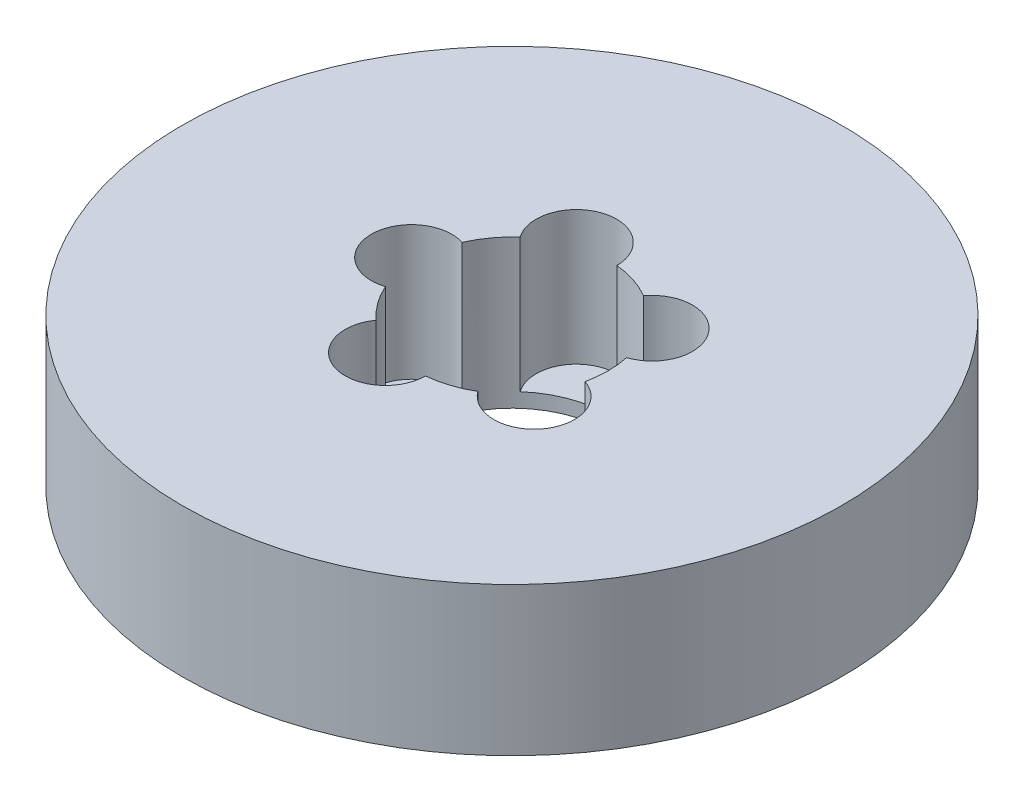
ISO-10303-21;
HEADER;
FILE_DESCRIPTION(('STEP AP214'),'2;1');
FILE_NAME('part.step','',(''),(''),'','','');
FILE_SCHEMA(('AUTOMOTIVE_DESIGN { 1 0 10303 214 1 1 1 1 }'));
ENDSEC;
DATA;
#1=APPLICATION_CONTEXT('core data for automotive mechanical design processes');
#2=APPLICATION_PROTOCOL_DEFINITION('international standard','automotive_design',2000,#1);
#3=PRODUCT_CONTEXT('',#1,'mechanical');
#4=PRODUCT('Part','Part','',(#3));
#5=PRODUCT_RELATED_PRODUCT_CATEGORY('part','',(#4));
#6=PRODUCT_DEFINITION_FORMATION('','',#4);
#7=PRODUCT_DEFINITION_CONTEXT('part definition',#1,'design');
#8=PRODUCT_DEFINITION('design','',#6,#7);
#9=PRODUCT_DEFINITION_SHAPE('','',#8);
#10=(LENGTH_UNIT() NAMED_UNIT(*) SI_UNIT(.MILLI.,.METRE.));
#11=(NAMED_UNIT(*) PLANE_ANGLE_UNIT() SI_UNIT($,.RADIAN.));
#12=(NAMED_UNIT(*) SI_UNIT($,.STERADIAN.) SOLID_ANGLE_UNIT());
#13=UNCERTAINTY_MEASURE_WITH_UNIT(LENGTH_MEASURE(1.E-05),#10,'distance_accuracy_value','');
#14=(GEOMETRIC_REPRESENTATION_CONTEXT(3) GLOBAL_UNCERTAINTY_ASSIGNED_CONTEXT((#13)) GLOBAL_UNIT_ASSIGNED_CONTEXT((#10,
#11,#12)) REPRESENTATION_CONTEXT('',''));
#15=CARTESIAN_POINT('',(0.,0.,0.));
#16=DIRECTION('',(0.,0.,1.));
#17=DIRECTION('',(1.,0.,0.));
#18=AXIS2_PLACEMENT_3D('',#15,#16,#17);
#19=CARTESIAN_POINT('',(0.,27.,0.));
#20=DIRECTION('',(0.,-1.,0.));
#21=DIRECTION('',(0.,0.,-1.));
#22=AXIS2_PLACEMENT_3D('',#19,#20,#21);
#23=CYLINDRICAL_SURFACE('',#22,60.);
#24=CARTESIAN_POINT('',(0.,27.,0.));
#25=DIRECTION('',(0.,1.,0.));
#26=DIRECTION('',(0.,0.,1.));
#27=AXIS2_PLACEMENT_3D('',#24,#25,#26);
#28=CIRCLE('',#27,60.);
#29=CARTESIAN_POINT('',(0.,27.,60.));
#30=VERTEX_POINT('',#29);
#31=EDGE_CURVE('E157',#30,#30,#28,.T.);
#32=ORIENTED_EDGE('',*,*,#31,.F.);
#33=EDGE_LOOP('',(#32));
#34=FACE_BOUND('',#33,.T.);
#35=CARTESIAN_POINT('',(0.,0.,0.));
#36=DIRECTION('',(0.,1.,0.));
#37=DIRECTION('',(0.,0.,1.));
#38=AXIS2_PLACEMENT_3D('',#35,#36,#37);
#39=CIRCLE('',#38,60.);
#40=CARTESIAN_POINT('',(0.,0.,60.));
#41=VERTEX_POINT('',#40);
#42=EDGE_CURVE('E150',#41,#41,#39,.T.);
#43=ORIENTED_EDGE('',*,*,#42,.T.);
#44=EDGE_LOOP('',(#43));
#45=FACE_BOUND('',#44,.T.);
#46=ADVANCED_FACE('F39',(#34,#45),#23,.T.);
#47=CARTESIAN_POINT('',(0.,27.,0.));
#48=DIRECTION('',(0.,1.,0.));
#49=DIRECTION('',(0.,0.,1.));
#50=AXIS2_PLACEMENT_3D('',#47,#48,#49);
#51=PLANE('',#50);
#52=CARTESIAN_POINT('',(-5.64754356066028,27.,-17.3813518421236));
#53=DIRECTION('',(0.,1.,0.));
#54=DIRECTION('',(-0.95105651629515,0.,0.309016994374958));
#55=AXIS2_PLACEMENT_3D('',#52,#53,#54);
#56=CIRCLE('',#55,7.3301434310173);
#57=CARTESIAN_POINT('',(1.68250353830002,27.,-17.4189317078749));
#58=VERTEX_POINT('',#57);
#59=CARTESIAN_POINT('',(-11.5997651241596,27.,-13.1032610087845));
#60=VERTEX_POINT('',#59);
#61=EDGE_CURVE('E194',#58,#60,#56,.T.);
#62=ORIENTED_EDGE('',*,*,#61,.F.);
#63=CARTESIAN_POINT('',(0.,27.,0.));
#64=DIRECTION('',(0.,1.,0.));
#65=DIRECTION('',(0.,0.,1.));
#66=AXIS2_PLACEMENT_3D('',#63,#64,#65);
#67=CIRCLE('',#66,17.5);
#68=CARTESIAN_POINT('',(8.87741721299759,27.,-15.0811625422702));
#69=VERTEX_POINT('',#68);
#70=EDGE_CURVE('E147',#69,#58,#67,.T.);
#71=ORIENTED_EDGE('',*,*,#70,.F.);
#72=CARTESIAN_POINT('',(14.7854609947536,27.,-10.7422662088531));
#73=DIRECTION('',(0.,1.,0.));
#74=DIRECTION('',(-0.58778525229248,0.,-0.809016994374942));
#75=AXIS2_PLACEMENT_3D('',#72,#73,#74);
#76=CIRCLE('',#75,7.3301434310173);
#77=CARTESIAN_POINT('',(17.0863106941053,27.,-3.78258996780003));
#78=VERTEX_POINT('',#77);
#79=EDGE_CURVE('E254',#78,#69,#76,.T.);
#80=ORIENTED_EDGE('',*,*,#79,.F.);
#81=CARTESIAN_POINT('',(17.0863106941054,27.,3.78258996779979));
#82=VERTEX_POINT('',#81);
#83=EDGE_CURVE('E144',#82,#78,#67,.T.);
#84=ORIENTED_EDGE('',*,*,#83,.F.);
#85=CARTESIAN_POINT('',(14.7854609947538,27.,10.7422662088529));
#86=DIRECTION('',(0.,1.,0.));
#87=DIRECTION('',(0.587785252292469,0.,-0.809016994374951));
#88=AXIS2_PLACEMENT_3D('',#85,#86,#87);
#89=CIRCLE('',#88,7.3301434310173);
#90=CARTESIAN_POINT('',(8.87741721299781,27.,15.0811625422701));
#91=VERTEX_POINT('',#90);
#92=EDGE_CURVE('E141',#91,#82,#89,.T.);
#93=ORIENTED_EDGE('',*,*,#92,.F.);
#94=CARTESIAN_POINT('',(1.68250353830026,27.,17.4189317078748));
#95=VERTEX_POINT('',#94);
#96=EDGE_CURVE('E134',#95,#91,#67,.T.);
#97=ORIENTED_EDGE('',*,*,#96,.F.);
#98=CARTESIAN_POINT('',(-5.64754356066003,27.,17.3813518421237));
#99=DIRECTION('',(0.,1.,0.));
#100=DIRECTION('',(0.951056516295155,0.,0.309016994374945));
#101=AXIS2_PLACEMENT_3D('',#98,#99,#100);
#102=CIRCLE('',#101,7.3301434310173);
#103=CARTESIAN_POINT('',(-11.5997651241594,27.,13.1032610087846));
#104=VERTEX_POINT('',#103);
#105=EDGE_CURVE('E111',#104,#95,#102,.T.);
#106=ORIENTED_EDGE('',*,*,#105,.F.);
#107=CARTESIAN_POINT('',(-16.0464663212439,27.,6.98290187538002));
#108=VERTEX_POINT('',#107);
#109=EDGE_CURVE('E145',#108,#104,#67,.T.);
#110=ORIENTED_EDGE('',*,*,#109,.F.);
#111=CARTESIAN_POINT('',(-18.2758348681872,27.,0.));
#112=DIRECTION('',(0.,1.,0.));
#113=DIRECTION('',(0.,0.,1.));
#114=AXIS2_PLACEMENT_3D('',#111,#112,#113);
#115=CIRCLE('',#114,7.3301434310173);
#116=CARTESIAN_POINT('',(-16.0464663212439,27.,-6.98290187538002));
#117=VERTEX_POINT('',#116);
#118=EDGE_CURVE('E153',#117,#108,#115,.T.);
#119=ORIENTED_EDGE('',*,*,#118,.F.);
#120=EDGE_CURVE('E146',#60,#117,#67,.T.);
#121=ORIENTED_EDGE('',*,*,#120,.F.);
#122=EDGE_LOOP('',(#62,#71,#80,#84,#93,#97,#106,#110,#119,#121));
#123=FACE_BOUND('',#122,.T.);
#124=ORIENTED_EDGE('',*,*,#31,.T.);
#125=EDGE_LOOP('',(#124));
#126=FACE_BOUND('',#125,.T.);
#127=ADVANCED_FACE('F139',(#123,#126),#51,.T.);
#128=CARTESIAN_POINT('',(0.,0.,0.));
#129=DIRECTION('',(0.,1.,0.));
#130=DIRECTION('',(0.,0.,1.));
#131=AXIS2_PLACEMENT_3D('',#128,#129,#130);
#132=PLANE('',#131);
#133=CARTESIAN_POINT('',(0.,0.,0.));
#134=DIRECTION('',(0.,1.,0.));
#135=DIRECTION('',(0.,0.,1.));
#136=AXIS2_PLACEMENT_3D('',#133,#134,#135);
#137=CIRCLE('',#136,17.5);
#138=CARTESIAN_POINT('',(0.,0.,17.5));
#139=VERTEX_POINT('',#138);
#140=EDGE_CURVE('E154',#139,#139,#137,.T.);
#141=ORIENTED_EDGE('',*,*,#140,.T.);
#142=EDGE_LOOP('',(#141));
#143=FACE_BOUND('',#142,.T.);
#144=ORIENTED_EDGE('',*,*,#42,.F.);
#145=EDGE_LOOP('',(#144));
#146=FACE_BOUND('',#145,.T.);
#147=ADVANCED_FACE('F213',(#143,#146),#132,.F.);
#148=CARTESIAN_POINT('',(0.,27.,0.));
#149=DIRECTION('',(0.,-1.,0.));
#150=DIRECTION('',(0.,0.,-1.));
#151=AXIS2_PLACEMENT_3D('',#148,#149,#150);
#152=CYLINDRICAL_SURFACE('',#151,17.5);
#153=DIRECTION('',(0.,1.,0.));
#154=VECTOR('',#153,1.);
#155=CARTESIAN_POINT('',(1.68250353830002,14.8099317861661,-17.4189317078749));
#156=LINE('',#155,#154);
#157=CARTESIAN_POINT('',(1.68250353830002,2.6198635723323,-17.4189317078749));
#158=VERTEX_POINT('',#157);
#159=EDGE_CURVE('E11',#158,#58,#156,.T.);
#160=ORIENTED_EDGE('',*,*,#159,.F.);
#161=CARTESIAN_POINT('',(0.,2.6198635723323,0.));
#162=DIRECTION('',(0.,1.,0.));
#163=DIRECTION('',(0.,0.,1.));
#164=AXIS2_PLACEMENT_3D('',#161,#162,#163);
#165=CIRCLE('',#164,17.5);
#166=CARTESIAN_POINT('',(-11.5997651241596,2.6198635723323,-13.1032610087845));
#167=VERTEX_POINT('',#166);
#168=EDGE_CURVE('E189',#158,#167,#165,.T.);
#169=ORIENTED_EDGE('',*,*,#168,.T.);
#170=DIRECTION('',(0.,1.,0.));
#171=VECTOR('',#170,1.);
#172=CARTESIAN_POINT('',(-11.5997651241596,14.8099317861661,-13.1032610087845));
#173=LINE('',#172,#171);
#174=EDGE_CURVE('E46',#60,#167,#173,.F.);
#175=ORIENTED_EDGE('',*,*,#174,.F.);
#176=ORIENTED_EDGE('',*,*,#120,.T.);
#177=DIRECTION('',(0.,1.,0.));
#178=VECTOR('',#177,1.);
#179=CARTESIAN_POINT('',(-16.0464663212439,14.8099317861661,-6.98290187538002));
#180=LINE('',#179,#178);
#181=CARTESIAN_POINT('',(-16.0464663212439,2.6198635723323,-6.98290187538002));
#182=VERTEX_POINT('',#181);
#183=EDGE_CURVE('E168',#182,#117,#180,.T.);
#184=ORIENTED_EDGE('',*,*,#183,.F.);
#185=CARTESIAN_POINT('',(0.,2.6198635723323,0.));
#186=DIRECTION('',(0.,1.,0.));
#187=DIRECTION('',(0.,0.,1.));
#188=AXIS2_PLACEMENT_3D('',#185,#186,#187);
#189=CIRCLE('',#188,17.5);
#190=CARTESIAN_POINT('',(-16.0464663212439,2.6198635723323,6.98290187538002));
#191=VERTEX_POINT('',#190);
#192=EDGE_CURVE('E165',#182,#191,#189,.T.);
#193=ORIENTED_EDGE('',*,*,#192,.T.);
#194=DIRECTION('',(0.,1.,0.));
#195=VECTOR('',#194,1.);
#196=CARTESIAN_POINT('',(-16.0464663212439,14.8099317861661,6.98290187538002));
#197=LINE('',#196,#195);
#198=EDGE_CURVE('E170',#108,#191,#197,.F.);
#199=ORIENTED_EDGE('',*,*,#198,.F.);
#200=ORIENTED_EDGE('',*,*,#109,.T.);
#201=DIRECTION('',(0.,1.,0.));
#202=VECTOR('',#201,1.);
#203=CARTESIAN_POINT('',(-11.5997651241594,14.8099317861661,13.1032610087846));
#204=LINE('',#203,#202);
#205=CARTESIAN_POINT('',(-11.5997651241594,2.6198635723323,13.1032610087846));
#206=VERTEX_POINT('',#205);
#207=EDGE_CURVE('E121',#206,#104,#204,.T.);
#208=ORIENTED_EDGE('',*,*,#207,.F.);
#209=CARTESIAN_POINT('',(0.,2.6198635723323,0.));
#210=DIRECTION('',(0.,1.,0.));
#211=DIRECTION('',(0.,0.,1.));
#212=AXIS2_PLACEMENT_3D('',#209,#210,#211);
#213=CIRCLE('',#212,17.5);
#214=CARTESIAN_POINT('',(1.68250353830026,2.6198635723323,17.4189317078748));
#215=VERTEX_POINT('',#214);
#216=EDGE_CURVE('E136',#206,#215,#213,.T.);
#217=ORIENTED_EDGE('',*,*,#216,.T.);
#218=DIRECTION('',(0.,1.,0.));
#219=VECTOR('',#218,1.);
#220=CARTESIAN_POINT('',(1.68250353830026,14.8099317861661,17.4189317078748));
#221=LINE('',#220,#219);
#222=EDGE_CURVE('E117',#95,#215,#221,.F.);
#223=ORIENTED_EDGE('',*,*,#222,.F.);
#224=ORIENTED_EDGE('',*,*,#96,.T.);
#225=DIRECTION('',(0.,1.,0.));
#226=VECTOR('',#225,1.);
#227=CARTESIAN_POINT('',(8.8774172129978,14.8099317861661,15.0811625422701));
#228=LINE('',#227,#226);
#229=CARTESIAN_POINT('',(8.87741721299781,2.6198635723323,15.0811625422701));
#230=VERTEX_POINT('',#229);
#231=EDGE_CURVE('E182',#230,#91,#228,.T.);
#232=ORIENTED_EDGE('',*,*,#231,.F.);
#233=CARTESIAN_POINT('',(0.,2.6198635723323,0.));
#234=DIRECTION('',(0.,1.,0.));
#235=DIRECTION('',(0.,0.,1.));
#236=AXIS2_PLACEMENT_3D('',#233,#234,#235);
#237=CIRCLE('',#236,17.5);
#238=CARTESIAN_POINT('',(17.0863106941054,2.6198635723323,3.78258996779979));
#239=VERTEX_POINT('',#238);
#240=EDGE_CURVE('E174',#230,#239,#237,.T.);
#241=ORIENTED_EDGE('',*,*,#240,.T.);
#242=DIRECTION('',(0.,1.,0.));
#243=VECTOR('',#242,1.);
#244=CARTESIAN_POINT('',(17.0863106941054,14.8099317861661,3.78258996779978));
#245=LINE('',#244,#243);
#246=EDGE_CURVE('E177',#82,#239,#245,.F.);
#247=ORIENTED_EDGE('',*,*,#246,.F.);
#248=ORIENTED_EDGE('',*,*,#83,.T.);
#249=DIRECTION('',(0.,1.,0.));
#250=VECTOR('',#249,1.);
#251=CARTESIAN_POINT('',(17.0863106941053,14.8099317861661,-3.78258996780003));
#252=LINE('',#251,#250);
#253=CARTESIAN_POINT('',(17.0863106941053,2.6198635723323,-3.78258996780003));
#254=VERTEX_POINT('',#253);
#255=EDGE_CURVE('E187',#254,#78,#252,.T.);
#256=ORIENTED_EDGE('',*,*,#255,.F.);
#257=CARTESIAN_POINT('',(0.,2.6198635723323,0.));
#258=DIRECTION('',(0.,1.,0.));
#259=DIRECTION('',(0.,0.,1.));
#260=AXIS2_PLACEMENT_3D('',#257,#258,#259);
#261=CIRCLE('',#260,17.5);
#262=CARTESIAN_POINT('',(8.87741721299759,2.6198635723323,-15.0811625422702));
#263=VERTEX_POINT('',#262);
#264=EDGE_CURVE('E181',#254,#263,#261,.T.);
#265=ORIENTED_EDGE('',*,*,#264,.T.);
#266=DIRECTION('',(0.,1.,0.));
#267=VECTOR('',#266,1.);
#268=CARTESIAN_POINT('',(8.87741721299759,14.8099317861661,-15.0811625422702));
#269=LINE('',#268,#267);
#270=EDGE_CURVE('E186',#69,#263,#269,.F.);
#271=ORIENTED_EDGE('',*,*,#270,.F.);
#272=ORIENTED_EDGE('',*,*,#70,.T.);
#273=EDGE_LOOP('',(#160,#169,#175,#176,#184,#193,#199,#200,#208,#217,#223,#224,#232,#241,#247,
#248,#256,#265,#271,#272));
#274=FACE_BOUND('',#273,.T.);
#275=ORIENTED_EDGE('',*,*,#140,.F.);
#276=EDGE_LOOP('',(#275));
#277=FACE_BOUND('',#276,.T.);
#278=ADVANCED_FACE('F135',(#274,#277),#152,.F.);
#279=CARTESIAN_POINT('',(-18.2758348681872,2.6198635723323,0.));
#280=DIRECTION('',(0.,1.,0.));
#281=DIRECTION('',(0.,0.,1.));
#282=AXIS2_PLACEMENT_3D('',#279,#280,#281);
#283=CYLINDRICAL_SURFACE('',#282,7.3301434310173);
#284=ORIENTED_EDGE('',*,*,#183,.T.);
#285=ORIENTED_EDGE('',*,*,#118,.T.);
#286=ORIENTED_EDGE('',*,*,#198,.T.);
#287=CARTESIAN_POINT('',(-18.2758348681872,2.6198635723323,0.));
#288=DIRECTION('',(0.,1.,0.));
#289=DIRECTION('',(0.,0.,1.));
#290=AXIS2_PLACEMENT_3D('',#287,#288,#289);
#291=CIRCLE('',#290,7.3301434310173);
#292=EDGE_CURVE('E158',#182,#191,#291,.T.);
#293=ORIENTED_EDGE('',*,*,#292,.F.);
#294=EDGE_LOOP('',(#284,#285,#286,#293));
#295=FACE_BOUND('',#294,.T.);
#296=ADVANCED_FACE('F221',(#295),#283,.F.);
#297=CARTESIAN_POINT('',(-18.2758348681872,2.6198635723323,0.));
#298=DIRECTION('',(0.,1.,0.));
#299=DIRECTION('',(0.,0.,1.));
#300=AXIS2_PLACEMENT_3D('',#297,#298,#299);
#301=PLANE('',#300);
#302=ORIENTED_EDGE('',*,*,#292,.T.);
#303=ORIENTED_EDGE('',*,*,#192,.F.);
#304=EDGE_LOOP('',(#302,#303));
#305=FACE_BOUND('',#304,.T.);
#306=ADVANCED_FACE('F227',(#305),#301,.T.);
#307=CARTESIAN_POINT('',(-5.64754356066003,2.6198635723323,17.3813518421237));
#308=DIRECTION('',(0.,1.,0.));
#309=DIRECTION('',(0.,0.,1.));
#310=AXIS2_PLACEMENT_3D('',#307,#308,#309);
#311=CYLINDRICAL_SURFACE('',#310,7.3301434310173);
#312=ORIENTED_EDGE('',*,*,#207,.T.);
#313=ORIENTED_EDGE('',*,*,#105,.T.);
#314=ORIENTED_EDGE('',*,*,#222,.T.);
#315=CARTESIAN_POINT('',(-5.64754356066003,2.6198635723323,17.3813518421237));
#316=DIRECTION('',(0.,1.,0.));
#317=DIRECTION('',(0.951056516295155,0.,0.309016994374945));
#318=AXIS2_PLACEMENT_3D('',#315,#316,#317);
#319=CIRCLE('',#318,7.3301434310173);
#320=EDGE_CURVE('E127',#206,#215,#319,.T.);
#321=ORIENTED_EDGE('',*,*,#320,.F.);
#322=EDGE_LOOP('',(#312,#313,#314,#321));
#323=FACE_BOUND('',#322,.T.);
#324=ADVANCED_FACE('F116',(#323),#311,.F.);
#325=CARTESIAN_POINT('',(-5.64754356066003,2.6198635723323,17.3813518421237));
#326=DIRECTION('',(0.,1.,0.));
#327=DIRECTION('',(0.951056516295155,0.,0.309016994374945));
#328=AXIS2_PLACEMENT_3D('',#325,#326,#327);
#329=PLANE('',#328);
#330=ORIENTED_EDGE('',*,*,#320,.T.);
#331=ORIENTED_EDGE('',*,*,#216,.F.);
#332=EDGE_LOOP('',(#330,#331));
#333=FACE_BOUND('',#332,.T.);
#334=ADVANCED_FACE('F234',(#333),#329,.T.);
#335=CARTESIAN_POINT('',(14.7854609947538,2.6198635723323,10.7422662088529));
#336=DIRECTION('',(0.,1.,0.));
#337=DIRECTION('',(0.,0.,1.));
#338=AXIS2_PLACEMENT_3D('',#335,#336,#337);
#339=CYLINDRICAL_SURFACE('',#338,7.3301434310173);
#340=ORIENTED_EDGE('',*,*,#231,.T.);
#341=ORIENTED_EDGE('',*,*,#92,.T.);
#342=ORIENTED_EDGE('',*,*,#246,.T.);
#343=CARTESIAN_POINT('',(14.7854609947538,2.6198635723323,10.7422662088529));
#344=DIRECTION('',(0.,1.,0.));
#345=DIRECTION('',(0.587785252292469,0.,-0.809016994374951));
#346=AXIS2_PLACEMENT_3D('',#343,#344,#345);
#347=CIRCLE('',#346,7.3301434310173);
#348=EDGE_CURVE('E130',#230,#239,#347,.T.);
#349=ORIENTED_EDGE('',*,*,#348,.F.);
#350=EDGE_LOOP('',(#340,#341,#342,#349));
#351=FACE_BOUND('',#350,.T.);
#352=ADVANCED_FACE('F240',(#351),#339,.F.);
#353=CARTESIAN_POINT('',(14.7854609947538,2.6198635723323,10.7422662088529));
#354=DIRECTION('',(0.,1.,0.));
#355=DIRECTION('',(0.587785252292469,0.,-0.809016994374951));
#356=AXIS2_PLACEMENT_3D('',#353,#354,#355);
#357=PLANE('',#356);
#358=ORIENTED_EDGE('',*,*,#348,.T.);
#359=ORIENTED_EDGE('',*,*,#240,.F.);
#360=EDGE_LOOP('',(#358,#359));
#361=FACE_BOUND('',#360,.T.);
#362=ADVANCED_FACE('F245',(#361),#357,.T.);
#363=CARTESIAN_POINT('',(14.7854609947536,2.6198635723323,-10.7422662088531));
#364=DIRECTION('',(0.,1.,0.));
#365=DIRECTION('',(0.,0.,1.));
#366=AXIS2_PLACEMENT_3D('',#363,#364,#365);
#367=CYLINDRICAL_SURFACE('',#366,7.3301434310173);
#368=ORIENTED_EDGE('',*,*,#255,.T.);
#369=ORIENTED_EDGE('',*,*,#79,.T.);
#370=ORIENTED_EDGE('',*,*,#270,.T.);
#371=CARTESIAN_POINT('',(14.7854609947536,2.6198635723323,-10.7422662088531));
#372=DIRECTION('',(0.,1.,0.));
#373=DIRECTION('',(-0.58778525229248,0.,-0.809016994374942));
#374=AXIS2_PLACEMENT_3D('',#371,#372,#373);
#375=CIRCLE('',#374,7.3301434310173);
#376=EDGE_CURVE('E56',#254,#263,#375,.T.);
#377=ORIENTED_EDGE('',*,*,#376,.F.);
#378=EDGE_LOOP('',(#368,#369,#370,#377));
#379=FACE_BOUND('',#378,.T.);
#380=ADVANCED_FACE('F266',(#379),#367,.F.);
#381=CARTESIAN_POINT('',(14.7854609947536,2.6198635723323,-10.7422662088531));
#382=DIRECTION('',(0.,1.,0.));
#383=DIRECTION('',(-0.58778525229248,0.,-0.809016994374942));
#384=AXIS2_PLACEMENT_3D('',#381,#382,#383);
#385=PLANE('',#384);
#386=ORIENTED_EDGE('',*,*,#376,.T.);
#387=ORIENTED_EDGE('',*,*,#264,.F.);
#388=EDGE_LOOP('',(#386,#387));
#389=FACE_BOUND('',#388,.T.);
#390=ADVANCED_FACE('F204',(#389),#385,.T.);
#391=CARTESIAN_POINT('',(-5.64754356066028,2.6198635723323,-17.3813518421236));
#392=DIRECTION('',(0.,1.,0.));
#393=DIRECTION('',(0.,0.,1.));
#394=AXIS2_PLACEMENT_3D('',#391,#392,#393);
#395=CYLINDRICAL_SURFACE('',#394,7.3301434310173);
#396=ORIENTED_EDGE('',*,*,#159,.T.);
#397=ORIENTED_EDGE('',*,*,#61,.T.);
#398=ORIENTED_EDGE('',*,*,#174,.T.);
#399=CARTESIAN_POINT('',(-5.64754356066028,2.6198635723323,-17.3813518421236));
#400=DIRECTION('',(0.,1.,0.));
#401=DIRECTION('',(-0.95105651629515,0.,0.309016994374958));
#402=AXIS2_PLACEMENT_3D('',#399,#400,#401);
#403=CIRCLE('',#402,7.3301434310173);
#404=EDGE_CURVE('E55',#158,#167,#403,.T.);
#405=ORIENTED_EDGE('',*,*,#404,.F.);
#406=EDGE_LOOP('',(#396,#397,#398,#405));
#407=FACE_BOUND('',#406,.T.);
#408=ADVANCED_FACE('F193',(#407),#395,.F.);
#409=CARTESIAN_POINT('',(-5.64754356066028,2.6198635723323,-17.3813518421236));
#410=DIRECTION('',(0.,1.,0.));
#411=DIRECTION('',(-0.95105651629515,0.,0.309016994374958));
#412=AXIS2_PLACEMENT_3D('',#409,#410,#411);
#413=PLANE('',#412);
#414=ORIENTED_EDGE('',*,*,#404,.T.);
#415=ORIENTED_EDGE('',*,*,#168,.F.);
#416=EDGE_LOOP('',(#414,#415));
#417=FACE_BOUND('',#416,.T.);
#418=ADVANCED_FACE('F196',(#417),#413,.T.);
#419=CLOSED_SHELL('',(#46,#127,#147,#278,#296,#306,#324,#334,#352,#362,#380,#390,#408,#418));
#420=MANIFOLD_SOLID_BREP('B2',#419);
#421=ADVANCED_BREP_SHAPE_REPRESENTATION('',(#18,#420),#14);
#422=SHAPE_DEFINITION_REPRESENTATION(#9,#421);
ENDSEC;
END-ISO-10303-21;
